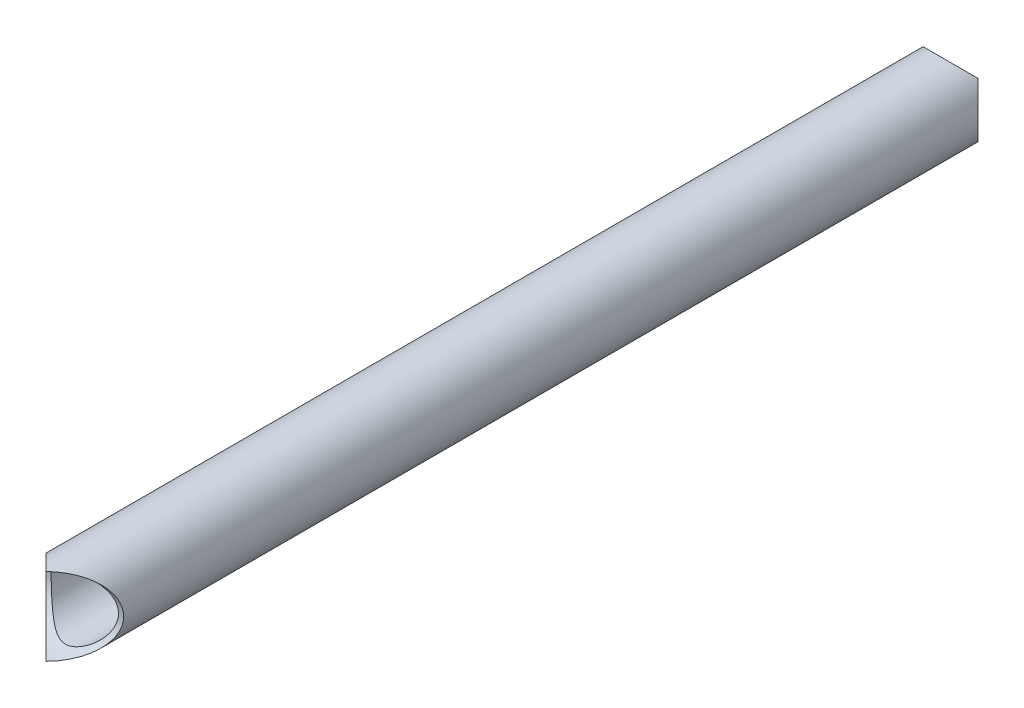
ISO-10303-21;
HEADER;
FILE_DESCRIPTION(('STEP AP214'),'2;1');
FILE_NAME('part.step','',(''),(''),'','','');
FILE_SCHEMA(('AUTOMOTIVE_DESIGN { 1 0 10303 214 1 1 1 1 }'));
ENDSEC;
DATA;
#1=APPLICATION_CONTEXT('core data for automotive mechanical design processes');
#2=APPLICATION_PROTOCOL_DEFINITION('international standard','automotive_design',2000,#1);
#3=PRODUCT_CONTEXT('',#1,'mechanical');
#4=PRODUCT('Part','Part','',(#3));
#5=PRODUCT_RELATED_PRODUCT_CATEGORY('part','',(#4));
#6=PRODUCT_DEFINITION_FORMATION('','',#4);
#7=PRODUCT_DEFINITION_CONTEXT('part definition',#1,'design');
#8=PRODUCT_DEFINITION('design','',#6,#7);
#9=PRODUCT_DEFINITION_SHAPE('','',#8);
#10=(LENGTH_UNIT() NAMED_UNIT(*) SI_UNIT(.MILLI.,.METRE.));
#11=(NAMED_UNIT(*) PLANE_ANGLE_UNIT() SI_UNIT($,.RADIAN.));
#12=(NAMED_UNIT(*) SI_UNIT($,.STERADIAN.) SOLID_ANGLE_UNIT());
#13=UNCERTAINTY_MEASURE_WITH_UNIT(LENGTH_MEASURE(1.E-05),#10,'distance_accuracy_value','');
#14=(GEOMETRIC_REPRESENTATION_CONTEXT(3) GLOBAL_UNCERTAINTY_ASSIGNED_CONTEXT((#13)) GLOBAL_UNIT_ASSIGNED_CONTEXT((#10,
#11,#12)) REPRESENTATION_CONTEXT('',''));
#15=CARTESIAN_POINT('',(0.,0.,0.));
#16=DIRECTION('',(0.,0.,1.));
#17=DIRECTION('',(1.,0.,0.));
#18=AXIS2_PLACEMENT_3D('',#15,#16,#17);
#19=CARTESIAN_POINT('',(-161.925,-228.6,0.));
#20=DIRECTION('',(1.,0.,0.));
#21=DIRECTION('',(0.,0.,-1.));
#22=AXIS2_PLACEMENT_3D('',#19,#20,#21);
#23=CYLINDRICAL_SURFACE('',#22,9.52499999999998);
#24=CARTESIAN_POINT('',(0.,-228.6,0.));
#25=DIRECTION('',(0.707106781186547,0.,0.707106781186547));
#26=DIRECTION('',(-0.707106781186547,0.,0.707106781186547));
#27=AXIS2_PLACEMENT_3D('',#24,#25,#26);
#28=ELLIPSE('',#27,13.4703841816037,9.52499999999999);
#29=CARTESIAN_POINT('',(0.,-238.125,0.));
#30=VERTEX_POINT('',#29);
#31=CARTESIAN_POINT('',(0.,-219.075,0.));
#32=VERTEX_POINT('',#31);
#33=EDGE_CURVE('E73',#30,#32,#28,.T.);
#34=ORIENTED_EDGE('',*,*,#33,.T.);
#35=CARTESIAN_POINT('',(0.,-228.6,0.));
#36=DIRECTION('',(-0.707106781186547,0.,0.707106781186547));
#37=DIRECTION('',(0.707106781186547,0.,0.707106781186547));
#38=AXIS2_PLACEMENT_3D('',#35,#36,#37);
#39=ELLIPSE('',#38,13.4703841816037,9.52499999999999);
#40=EDGE_CURVE('E71',#32,#30,#39,.T.);
#41=ORIENTED_EDGE('',*,*,#40,.T.);
#42=EDGE_LOOP('',(#34,#41));
#43=FACE_BOUND('',#42,.T.);
#44=CARTESIAN_POINT('',(8.255,-228.6,-9.52499999999998));
#45=CARTESIAN_POINT('',(8.2549991309736,-228.406250866017,-9.52499914862957));
#46=CARTESIAN_POINT('',(8.24816678082066,-228.212489304632,-9.51907602387494));
#47=CARTESIAN_POINT('',(8.22096978778912,-227.826631422453,-9.49551993069773));
#48=CARTESIAN_POINT('',(8.20060395213658,-227.634535249952,-9.47788593013703));
#49=CARTESIAN_POINT('',(8.14671669800962,-227.253494245892,-9.43129946891753));
#50=CARTESIAN_POINT('',(8.11318830370018,-227.064551140828,-9.4023410066018));
#51=CARTESIAN_POINT('',(8.03357968300137,-226.691325809148,-9.33373426055012));
#52=CARTESIAN_POINT('',(7.98749944772571,-226.507043585832,-9.29408596924612));
#53=CARTESIAN_POINT('',(7.88387682013201,-226.145482745751,-9.20518387045815));
#54=CARTESIAN_POINT('',(7.82641012090954,-225.968166681786,-9.15599353806628));
#55=CARTESIAN_POINT('',(7.70062697305925,-225.620129557817,-9.04871137350904));
#56=CARTESIAN_POINT('',(7.63230577878792,-225.44941142324,-8.99061564825054));
#57=CARTESIAN_POINT('',(7.48568628536985,-225.115348117664,-8.86648613376939));
#58=CARTESIAN_POINT('',(7.40738906925857,-224.952002148917,-8.80045320628406));
#59=CARTESIAN_POINT('',(7.24162523096909,-224.633112425986,-8.66139148346517));
#60=CARTESIAN_POINT('',(7.15415660082005,-224.477570391447,-8.58836115643808));
#61=CARTESIAN_POINT('',(6.93563606350437,-224.116475044909,-8.40705776916898));
#62=CARTESIAN_POINT('',(6.80073731523927,-223.914627571719,-8.29601262769738));
#63=CARTESIAN_POINT('',(6.51661799509544,-223.526881378591,-8.064743848003));
#64=CARTESIAN_POINT('',(6.36739233738686,-223.340988366918,-7.94451695352175));
#65=CARTESIAN_POINT('',(6.05568545559865,-222.984857023593,-7.69694275303351));
#66=CARTESIAN_POINT('',(5.89317377902942,-222.814656672967,-7.56957931222031));
#67=CARTESIAN_POINT('',(5.55624676339453,-222.490349874275,-7.31032763517803));
#68=CARTESIAN_POINT('',(5.38183301047559,-222.336241288616,-7.17844000303208));
#69=CARTESIAN_POINT('',(5.01788704155433,-222.040890582044,-6.90973126096918));
#70=CARTESIAN_POINT('',(4.82811425764211,-221.899986610464,-6.77286471020445));
#71=CARTESIAN_POINT('',(4.43682954916942,-221.634695381101,-6.4997229701736));
#72=CARTESIAN_POINT('',(4.23531384968986,-221.510313477172,-6.36344798637052));
#73=CARTESIAN_POINT('',(3.82063329870359,-221.278516699451,-6.09531136489423));
#74=CARTESIAN_POINT('',(3.60749309828619,-221.171067666948,-5.96344127621439));
#75=CARTESIAN_POINT('',(3.16843181970336,-220.973470149248,-5.70855763052586));
#76=CARTESIAN_POINT('',(2.94252102945852,-220.883307987932,-5.58553712092024));
#77=CARTESIAN_POINT('',(2.4668144299832,-220.717996418519,-5.34987442057174));
#78=CARTESIAN_POINT('',(2.21641466916663,-220.643633336703,-5.23788214298108));
#79=CARTESIAN_POINT('',(1.69963891728647,-220.517519256837,-5.04111943195066));
#80=CARTESIAN_POINT('',(1.43329846759253,-220.465719940797,-4.95629093434712));
#81=CARTESIAN_POINT('',(1.04394084534311,-220.410426737363,-4.86390243338424));
#82=CARTESIAN_POINT('',(0.926240140688908,-220.396260607156,-4.83991842714093));
#83=CARTESIAN_POINT('',(0.688990887447115,-220.372941215348,-4.80017344286397));
#84=CARTESIAN_POINT('',(0.569443240154016,-220.363785583455,-4.78440857680622));
#85=CARTESIAN_POINT('',(0.32932033933736,-220.350695800613,-4.76180407323091));
#86=CARTESIAN_POINT('',(0.208746073071973,-220.346757102303,-4.75495666286135));
#87=CARTESIAN_POINT('',(-0.0326338460709517,-220.344182219285,-4.75048470187358));
#88=CARTESIAN_POINT('',(-0.153439501382194,-220.345546090658,-4.75286024879897));
#89=CARTESIAN_POINT('',(-0.394165546022784,-220.353537911923,-4.76671281142092));
#90=CARTESIAN_POINT('',(-0.514086996621967,-220.360157910279,-4.77817607905761));
#91=CARTESIAN_POINT('',(-0.752426471254528,-220.378492094755,-4.80965247391343));
#92=CARTESIAN_POINT('',(-0.870843834060159,-220.390208446644,-4.82966923600071));
#93=CARTESIAN_POINT('',(-1.22310602414186,-220.432691819621,-4.90141020066696));
#94=CARTESIAN_POINT('',(-1.45376292887387,-220.47078599086,-4.96481146964582));
#95=CARTESIAN_POINT('',(-1.8637072758493,-220.555900672935,-5.10130504482208));
#96=CARTESIAN_POINT('',(-2.04487996617523,-220.60016196055,-5.17071608363481));
#97=CARTESIAN_POINT('',(-2.39953345699059,-220.699294360388,-5.32095731682424));
#98=CARTESIAN_POINT('',(-2.57300885110583,-220.754172789204,-5.401795375498));
#99=CARTESIAN_POINT('',(-2.91302040075858,-220.87394281657,-5.57175995210491));
#100=CARTESIAN_POINT('',(-3.07953040069081,-220.938868485421,-5.66091424590629));
#101=CARTESIAN_POINT('',(-3.40543837179338,-221.078072533404,-5.84461572787481));
#102=CARTESIAN_POINT('',(-3.56483714546782,-221.152349853564,-5.93916230476347));
#103=CARTESIAN_POINT('',(-3.95950975045312,-221.351633994807,-6.18246639561205));
#104=CARTESIAN_POINT('',(-4.19036061822675,-221.482704521305,-6.33346592764865));
#105=CARTESIAN_POINT('',(-4.63747538270588,-221.765614163585,-6.63777489853455));
#106=CARTESIAN_POINT('',(-4.85373191319782,-221.917463651808,-6.79108545677487));
#107=CARTESIAN_POINT('',(-5.27132385376,-222.241702561116,-7.09556835836744));
#108=CARTESIAN_POINT('',(-5.47267772045483,-222.414065861768,-7.2467431523944));
#109=CARTESIAN_POINT('',(-5.85993838639313,-222.77960613111,-7.54347617660761));
#110=CARTESIAN_POINT('',(-6.04585204532008,-222.972773768413,-7.68903688542415));
#111=CARTESIAN_POINT('',(-6.35820893639354,-223.33119127101,-7.93730120225209));
#112=CARTESIAN_POINT('',(-6.48822041734563,-223.492023598625,-8.04190982332076));
#113=CARTESIAN_POINT('',(-6.73756594349463,-223.825736010478,-8.24439807207286));
#114=CARTESIAN_POINT('',(-6.8569023290982,-223.998613439092,-8.34227917360141));
#115=CARTESIAN_POINT('',(-7.08366003651115,-224.356002397326,-8.52964066539285));
#116=CARTESIAN_POINT('',(-7.19109566852846,-224.540499526382,-8.61913112474718));
#117=CARTESIAN_POINT('',(-7.39290924178342,-224.920837747688,-8.78821213101048));
#118=CARTESIAN_POINT('',(-7.4872896182541,-225.116676714618,-8.86780452395279));
#119=CARTESIAN_POINT('',(-7.64607452720217,-225.483103214577,-9.00231134156521));
#120=CARTESIAN_POINT('',(-7.71282515872356,-225.651989745094,-9.05909739341582));
#121=CARTESIAN_POINT('',(-7.83572387058532,-225.996188653913,-9.16395879695111));
#122=CARTESIAN_POINT('',(-7.89187416542448,-226.171499680925,-9.21203596790855));
#123=CARTESIAN_POINT('',(-7.99277926561637,-226.527624248783,-9.29862621941021));
#124=CARTESIAN_POINT('',(-8.03753797954922,-226.708435878407,-9.33714258026411));
#125=CARTESIAN_POINT('',(-8.11497986008862,-227.074508745958,-9.40388814271986));
#126=CARTESIAN_POINT('',(-8.14766289484144,-227.259770032446,-9.43211723199546));
#127=CARTESIAN_POINT('',(-8.20051181828125,-227.634306222712,-9.47780652362297));
#128=CARTESIAN_POINT('',(-8.22061737363726,-227.823596035694,-9.49521481683601));
#129=CARTESIAN_POINT('',(-8.24768993736896,-228.20381950668,-9.51866289629086));
#130=CARTESIAN_POINT('',(-8.25465691616095,-228.394753168383,-9.52470265693453));
#131=CARTESIAN_POINT('',(-8.2553183095402,-228.77664531477,-9.52527587201024));
#132=CARTESIAN_POINT('',(-8.24901373573472,-228.967603796453,-9.51981020342901));
#133=CARTESIAN_POINT('',(-8.22325492565545,-229.347952184751,-9.49749861914188));
#134=CARTESIAN_POINT('',(-8.20380124943699,-229.537342157826,-9.4806531881304));
#135=CARTESIAN_POINT('',(-8.1540812277602,-229.898723012674,-9.43766380719513));
#136=CARTESIAN_POINT('',(-8.12475103759838,-230.070940627884,-9.41232559052558));
#137=CARTESIAN_POINT('',(-8.05561104968294,-230.411738571797,-9.35270884257686));
#138=CARTESIAN_POINT('',(-8.01579775061753,-230.580317664858,-9.31842732431004));
#139=CARTESIAN_POINT('',(-7.92625943872895,-230.912806206632,-9.24151845756411));
#140=CARTESIAN_POINT('',(-7.87653736329026,-231.076717022802,-9.19889358247871));
#141=CARTESIAN_POINT('',(-7.76777500026876,-231.399227506909,-9.10593936756864));
#142=CARTESIAN_POINT('',(-7.70873123855654,-231.557825167848,-9.05560715548279));
#143=CARTESIAN_POINT('',(-7.57702515132398,-231.881239112751,-8.94374675295493));
#144=CARTESIAN_POINT('',(-7.50365911320604,-232.045572644807,-8.88165097638808));
#145=CARTESIAN_POINT('',(-7.34765599089072,-232.366815288716,-8.75025080214971));
#146=CARTESIAN_POINT('',(-7.26501525757022,-232.523721443506,-8.68094356792167));
#147=CARTESIAN_POINT('',(-7.00428589271642,-232.982783680093,-8.46353025136198));
#148=CARTESIAN_POINT('',(-6.81336884998682,-233.273334821802,-8.30591435659428));
#149=CARTESIAN_POINT('',(-6.4528327804719,-233.754931306402,-8.01320461595655));
#150=CARTESIAN_POINT('',(-6.28928934942985,-233.95301288062,-7.88192799380313));
#151=CARTESIAN_POINT('',(-5.94739409173013,-234.330473861314,-7.61190373485776));
#152=CARTESIAN_POINT('',(-5.76904131931243,-234.509852071695,-7.47315562111766));
#153=CARTESIAN_POINT('',(-5.398278386676,-234.850372890798,-7.19079436686123));
#154=CARTESIAN_POINT('',(-5.20583488153909,-235.011469781996,-7.04717014783944));
#155=CARTESIAN_POINT('',(-4.80788440247821,-235.315050172218,-6.75851614265842));
#156=CARTESIAN_POINT('',(-4.60238145150832,-235.457539362408,-6.61348680090241));
#157=CARTESIAN_POINT('',(-4.2217002215374,-235.696611503452,-6.35515925689216));
#158=CARTESIAN_POINT('',(-4.04894034477497,-235.796617427103,-6.24145035992457));
#159=CARTESIAN_POINT('',(-3.69470620817156,-235.984741839882,-6.0176875352289));
#160=CARTESIAN_POINT('',(-3.51323035552958,-236.072858144948,-5.90763428181521));
#161=CARTESIAN_POINT('',(-3.14146809775949,-236.236578933631,-5.69440913102359));
#162=CARTESIAN_POINT('',(-2.95120539019996,-236.312214812114,-5.59122036896025));
#163=CARTESIAN_POINT('',(-2.56091153040397,-236.450454207426,-5.39540026708197));
#164=CARTESIAN_POINT('',(-2.36088739974972,-236.513066926325,-5.30276149380798));
#165=CARTESIAN_POINT('',(-1.91710109618572,-236.633093878315,-5.11946097161144));
#166=CARTESIAN_POINT('',(-1.67147843973417,-236.688052450932,-5.03151344556335));
#167=CARTESIAN_POINT('',(-1.29366079541496,-236.754004837994,-4.92337591366435));
#168=CARTESIAN_POINT('',(-1.16625357807995,-236.773233391453,-4.89130870864691));
#169=CARTESIAN_POINT('',(-0.908760812182209,-236.805851299184,-4.83638807525044));
#170=CARTESIAN_POINT('',(-0.778676743118112,-236.819243792849,-4.81352969366667));
#171=CARTESIAN_POINT('',(-0.515053294315999,-236.839989631339,-4.77793189106003));
#172=CARTESIAN_POINT('',(-0.381491235325672,-236.84726952223,-4.76531560533642));
#173=CARTESIAN_POINT('',(-0.113582080058729,-236.855306107447,-4.75138012581389));
#174=CARTESIAN_POINT('',(0.0207649568470255,-236.85606328888,-4.75006008842709));
#175=CARTESIAN_POINT('',(0.289034938598474,-236.851029854125,-4.75879767507656));
#176=CARTESIAN_POINT('',(0.422957602740172,-236.845235558614,-4.76886169242112));
#177=CARTESIAN_POINT('',(0.689111683742139,-236.827268862574,-4.79979015185113));
#178=CARTESIAN_POINT('',(0.821342817729421,-236.815095409186,-4.82065637679742));
#179=CARTESIAN_POINT('',(1.10454643006355,-236.782206595522,-4.87630241943855));
#180=CARTESIAN_POINT('',(1.25505528789717,-236.760421364586,-4.91279727603147));
#181=CARTESIAN_POINT('',(1.55170325268703,-236.709250007172,-4.9968088443347));
#182=CARTESIAN_POINT('',(1.69783869586883,-236.679857696409,-5.0443345204492));
#183=CARTESIAN_POINT('',(1.98570912314555,-236.613978878295,-5.14835522742285));
#184=CARTESIAN_POINT('',(2.12742964309167,-236.577471421659,-5.20487665227993));
#185=CARTESIAN_POINT('',(2.40595811079111,-236.497933942537,-5.32479592263951));
#186=CARTESIAN_POINT('',(2.54276715365901,-236.454905385378,-5.38819222241241));
#187=CARTESIAN_POINT('',(2.90759118568054,-236.329831049898,-5.56725013397189));
#188=CARTESIAN_POINT('',(3.13110425848443,-236.241836566895,-5.68795470478585));
#189=CARTESIAN_POINT('',(3.56559758605923,-236.049031016719,-5.93823193042164));
#190=CARTESIAN_POINT('',(3.77656911147845,-235.944208420122,-6.06781063001079));
#191=CARTESIAN_POINT('',(4.18706965610036,-235.718175810107,-6.33146122219583));
#192=CARTESIAN_POINT('',(4.38658228697998,-235.596943119533,-6.46553913594523));
#193=CARTESIAN_POINT('',(4.77419601105202,-235.338421490995,-6.73454643258551));
#194=CARTESIAN_POINT('',(4.96229989336762,-235.201136501598,-6.869475598391));
#195=CARTESIAN_POINT('',(5.33822587447611,-234.901555904191,-7.14562965260795));
#196=CARTESIAN_POINT('',(5.52532860119196,-234.738244688044,-7.28673552413448));
#197=CARTESIAN_POINT('',(5.88601693765019,-234.393280486469,-7.5638943285916));
#198=CARTESIAN_POINT('',(6.05959990411033,-234.211623930162,-7.69994627070964));
#199=CARTESIAN_POINT('',(6.39160103031022,-233.830317575679,-7.96385928877271));
#200=CARTESIAN_POINT('',(6.55005185964248,-233.63070843393,-8.09173780370972));
#201=CARTESIAN_POINT('',(6.85042540907245,-233.21332127486,-8.33674937621355));
#202=CARTESIAN_POINT('',(6.99235568599343,-232.995551643368,-8.45388734147134));
#203=CARTESIAN_POINT('',(7.21895608703124,-232.608288566503,-8.64240803344506));
#204=CARTESIAN_POINT('',(7.30828007272975,-232.443156845253,-8.71719498210351));
#205=CARTESIAN_POINT('',(7.47660654907034,-232.104443279242,-8.85879069211981));
#206=CARTESIAN_POINT('',(7.55561158090454,-231.930863529438,-8.92560141738874));
#207=CARTESIAN_POINT('',(7.70228991439693,-231.576001146484,-9.0501032426944));
#208=CARTESIAN_POINT('',(7.76997311226874,-231.394725415898,-9.10780230457899));
#209=CARTESIAN_POINT('',(7.89311833522138,-231.025204306969,-9.2130828730719));
#210=CARTESIAN_POINT('',(7.94858170019484,-230.836959695403,-9.26066548891849));
#211=CARTESIAN_POINT('',(8.039551741935,-230.481346233512,-9.33887209356159));
#212=CARTESIAN_POINT('',(8.07676302214277,-230.314728334993,-9.37093582182724));
#213=CARTESIAN_POINT('',(8.14097036810243,-229.978041246021,-9.42633196678231));
#214=CARTESIAN_POINT('',(8.16796357789891,-229.807971104638,-9.44966194236373));
#215=CARTESIAN_POINT('',(8.21131805296771,-229.465488145167,-9.48716109489849));
#216=CARTESIAN_POINT('',(8.22768016098987,-229.293075513879,-9.50133099798964));
#217=CARTESIAN_POINT('',(8.24951956226246,-228.947111623887,-9.52024913405288));
#218=CARTESIAN_POINT('',(8.2550007784753,-228.773560798195,-9.52500076265902));
#219=CARTESIAN_POINT('',(8.255,-228.6,-9.52499999999998));
#220=B_SPLINE_CURVE_WITH_KNOTS('',3,(#44,#45,#46,#47,#48,#49,#50,#51,#52,#53,#54,#55,#56,#57,
#58,#59,#60,#61,#62,#63,#64,#65,#66,#67,#68,#69,#70,#71,#72,#73,#74,#75,#76,#77,#78,#79,#80,#81,
#82,#83,#84,#85,#86,#87,#88,#89,#90,#91,#92,#93,#94,#95,#96,#97,#98,#99,#100,#101,#102,#103,
#104,#105,#106,#107,#108,#109,#110,#111,#112,#113,#114,#115,#116,#117,#118,#119,#120,#121,#122,
#123,#124,#125,#126,#127,#128,#129,#130,#131,#132,#133,#134,#135,#136,#137,#138,#139,#140,#141,
#142,#143,#144,#145,#146,#147,#148,#149,#150,#151,#152,#153,#154,#155,#156,#157,#158,#159,#160,
#161,#162,#163,#164,#165,#166,#167,#168,#169,#170,#171,#172,#173,#174,#175,#176,#177,#178,#179,
#180,#181,#182,#183,#184,#185,#186,#187,#188,#189,#190,#191,#192,#193,#194,#195,#196,#197,#198,
#199,#200,#201,#202,#203,#204,#205,#206,#207,#208,#209,#210,#211,#212,#213,#214,#215,#216,#217,
#218,#219),.UNSPECIFIED.,.T.,.F.,(4,2,2,2,2,2,2,2,2,2,2,2,2,2,2,2,2,2,2,2,2,2,2,2,2,2,2,2,2,2,2,
2,2,2,2,2,2,2,2,2,2,2,2,2,2,2,2,2,2,2,2,2,2,2,2,2,2,2,2,2,2,2,2,2,2,2,2,2,2,2,2,2,2,2,2,2,2,2,2,
2,2,2,2,2,2,2,2,4),(0.,0.581060302241147,1.16217182303358,1.74359173542288,2.3250120594397,
2.90268969124201,3.48062058537871,4.05848879048118,4.63648377810275,5.4362169542025,
6.2362350802626,7.03814127970881,7.83994081992862,8.65857780584574,9.47747942119568,
10.2947073130675,11.1112859813718,11.9620431912297,12.8109695269324,13.1734956172863,
13.5358500604876,13.8978884475343,14.2599306635728,14.6214262186982,14.9830755469357,
15.706963144709,16.3031815010825,16.8998122025499,17.4985123074858,18.0971446771322,
19.0121600805803,19.927633918925,20.841954302152,21.7558662790183,22.450561462509,
23.1451039659047,23.8388020282263,24.5323705181271,25.1026275067059,25.6727652316906,
26.2427070714556,26.8126551342036,27.3853166471828,27.9579794496038,28.5305986031097,
29.1031933687764,29.6321866176356,30.1613567724987,30.6903702914557,31.2195814376323,
31.7901536941553,32.3609512342489,33.5023725912856,34.3667872613035,35.2312571774336,
36.0978433977629,36.9641639487797,37.6529096955541,38.341781789667,39.0288936791848,
39.715518398605,40.512573766315,40.9105237639805,41.3082594272077,41.7107088469782,
42.1131282121322,42.5157736890734,42.918485642225,43.38692566356,43.8557477127696,
44.32597156752,44.7960899166668,45.6013224389748,46.4071090223582,47.2140207141777,
48.020734336611,48.8767355197429,49.732903643882,50.5871794481831,51.441062941544,
52.0468024868874,52.6523925776822,53.2574505352096,53.862442115674,54.3830405578493,
54.9037844002805,55.4244869572118,55.9450017475653),.UNSPECIFIED.);
#221=CARTESIAN_POINT('',(8.255,-228.6,-9.52499999999998));
#222=VERTEX_POINT('',#221);
#223=EDGE_CURVE('E88',#222,#222,#220,.T.);
#224=ORIENTED_EDGE('',*,*,#223,.F.);
#225=EDGE_LOOP('',(#224));
#226=FACE_BOUND('',#225,.T.);
#227=ADVANCED_FACE('F33',(#43,#226),#23,.F.);
#228=CARTESIAN_POINT('',(0.,-219.075,-228.6));
#229=DIRECTION('',(0.,-1.,0.));
#230=DIRECTION('',(0.,0.,-1.));
#231=AXIS2_PLACEMENT_3D('',#228,#229,#230);
#232=CYLINDRICAL_SURFACE('',#231,9.525);
#233=CARTESIAN_POINT('',(0.,-228.6,-228.6));
#234=DIRECTION('',(0.707106781186547,-0.707106781186547,0.));
#235=DIRECTION('',(-0.707106781186547,-0.707106781186547,0.));
#236=AXIS2_PLACEMENT_3D('',#233,#234,#235);
#237=ELLIPSE('',#236,13.4703841816037,9.52499999999999);
#238=CARTESIAN_POINT('',(5.83716647869488,-222.762833521305,-221.073173809633));
#239=VERTEX_POINT('',#238);
#240=CARTESIAN_POINT('',(6.73519209080188,-221.864807909198,-221.864807909198));
#241=VERTEX_POINT('',#240);
#242=EDGE_CURVE('E47',#239,#241,#237,.F.);
#243=ORIENTED_EDGE('',*,*,#242,.F.);
#244=CARTESIAN_POINT('',(0.,-220.345,-219.075));
#245=CARTESIAN_POINT('',(-0.19374913398268,-220.345000869026,-219.075000851371));
#246=CARTESIAN_POINT('',(-0.387510695368521,-220.351833219179,-219.080923976125));
#247=CARTESIAN_POINT('',(-0.773368577546671,-220.379030212211,-219.104480069302));
#248=CARTESIAN_POINT('',(-0.965464750048011,-220.399396047863,-219.122114069863));
#249=CARTESIAN_POINT('',(-1.3465057541077,-220.45328330199,-219.168700531083));
#250=CARTESIAN_POINT('',(-1.53544885917171,-220.4868116963,-219.197658993398));
#251=CARTESIAN_POINT('',(-1.90867419085189,-220.566420316999,-219.26626573945));
#252=CARTESIAN_POINT('',(-2.0929564141682,-220.612500552274,-219.305914030754));
#253=CARTESIAN_POINT('',(-2.45451725424895,-220.716123179868,-219.394816129542));
#254=CARTESIAN_POINT('',(-2.63183331821414,-220.77358987909,-219.444006461934));
#255=CARTESIAN_POINT('',(-2.97987044218346,-220.899373026941,-219.551288626491));
#256=CARTESIAN_POINT('',(-3.1505885767598,-220.967694221212,-219.60938435175));
#257=CARTESIAN_POINT('',(-3.48465188233565,-221.11431371463,-219.733513866231));
#258=CARTESIAN_POINT('',(-3.64799785108294,-221.192610930741,-219.799546793716));
#259=CARTESIAN_POINT('',(-3.96688757401417,-221.358374769031,-219.938608516535));
#260=CARTESIAN_POINT('',(-4.12242960855341,-221.44584339918,-220.011638843562));
#261=CARTESIAN_POINT('',(-4.48352495509106,-221.664363936496,-220.192942230831));
#262=CARTESIAN_POINT('',(-4.68537242828053,-221.799262684761,-220.303987372303));
#263=CARTESIAN_POINT('',(-5.07311862140911,-222.083382004905,-220.535256151997));
#264=CARTESIAN_POINT('',(-5.25901163308174,-222.232607662613,-220.655483046478));
#265=CARTESIAN_POINT('',(-5.6151429764073,-222.544314544401,-220.903057246967));
#266=CARTESIAN_POINT('',(-5.78534332703313,-222.706826220971,-221.03042068778));
#267=CARTESIAN_POINT('',(-6.10965012572526,-223.043753236606,-221.289672364822));
#268=CARTESIAN_POINT('',(-6.26375871138404,-223.218166989524,-221.421559996968));
#269=CARTESIAN_POINT('',(-6.55910941795627,-223.582112958446,-221.690268739031));
#270=CARTESIAN_POINT('',(-6.7000133895365,-223.771885742358,-221.827135289796));
#271=CARTESIAN_POINT('',(-6.96530461889879,-224.163170450831,-222.100277029826));
#272=CARTESIAN_POINT('',(-7.08968652282799,-224.36468615031,-222.23655201363));
#273=CARTESIAN_POINT('',(-7.32148330054924,-224.779366701296,-222.504688635106));
#274=CARTESIAN_POINT('',(-7.42893233305181,-224.992506901714,-222.636558723786));
#275=CARTESIAN_POINT('',(-7.62652985075219,-225.431568180297,-222.891442369474));
#276=CARTESIAN_POINT('',(-7.71669201206841,-225.657478970542,-223.01446287908));
#277=CARTESIAN_POINT('',(-7.88200358148072,-226.133185570017,-223.250125579428));
#278=CARTESIAN_POINT('',(-7.95636666329742,-226.383585330833,-223.362117857019));
#279=CARTESIAN_POINT('',(-8.08248074316302,-226.900361082714,-223.558880568049));
#280=CARTESIAN_POINT('',(-8.1342800592027,-227.166701532408,-223.643709065653));
#281=CARTESIAN_POINT('',(-8.18957326263654,-227.556059154657,-223.736097566616));
#282=CARTESIAN_POINT('',(-8.20373939284397,-227.673759859311,-223.760081572859));
#283=CARTESIAN_POINT('',(-8.22705878465154,-227.911009112553,-223.799826557136));
#284=CARTESIAN_POINT('',(-8.23621441654546,-228.030556759846,-223.815591423194));
#285=CARTESIAN_POINT('',(-8.2493041993867,-228.270679660663,-223.838195926769));
#286=CARTESIAN_POINT('',(-8.25324289769712,-228.391253926928,-223.845043337139));
#287=CARTESIAN_POINT('',(-8.25581778071506,-228.632633846071,-223.849515298126));
#288=CARTESIAN_POINT('',(-8.25445390934166,-228.753439501382,-223.847139751201));
#289=CARTESIAN_POINT('',(-8.24646208807654,-228.994165546023,-223.833287188579));
#290=CARTESIAN_POINT('',(-8.2398420897209,-229.114086996622,-223.821823920942));
#291=CARTESIAN_POINT('',(-8.22150790524539,-229.352426471255,-223.790347526087));
#292=CARTESIAN_POINT('',(-8.20979155335593,-229.47084383406,-223.770330763999));
#293=CARTESIAN_POINT('',(-8.16730818037862,-229.823106024142,-223.698589799333));
#294=CARTESIAN_POINT('',(-8.12921400914041,-230.053762928874,-223.635188530354));
#295=CARTESIAN_POINT('',(-8.04409932706535,-230.463707275849,-223.498694955178));
#296=CARTESIAN_POINT('',(-7.99983803945024,-230.644879966175,-223.429283916365));
#297=CARTESIAN_POINT('',(-7.90070563961175,-230.999533456991,-223.279042683176));
#298=CARTESIAN_POINT('',(-7.84582721079586,-231.173008851106,-223.198204624502));
#299=CARTESIAN_POINT('',(-7.72605718342994,-231.513020400759,-223.028240047895));
#300=CARTESIAN_POINT('',(-7.66113151457858,-231.679530400691,-222.939085754094));
#301=CARTESIAN_POINT('',(-7.52192746659584,-232.005438371794,-222.755384272125));
#302=CARTESIAN_POINT('',(-7.44765014643552,-232.164837145468,-222.660837695236));
#303=CARTESIAN_POINT('',(-7.24836600519316,-232.559509750453,-222.417533604388));
#304=CARTESIAN_POINT('',(-7.11729547869542,-232.790360618227,-222.266534072351));
#305=CARTESIAN_POINT('',(-6.83438583641457,-233.237475382706,-221.962225101465));
#306=CARTESIAN_POINT('',(-6.68253634819236,-233.453731913198,-221.808914543225));
#307=CARTESIAN_POINT('',(-6.35829743888427,-233.87132385376,-221.504431641633));
#308=CARTESIAN_POINT('',(-6.18593413823202,-234.072677720455,-221.353256847606));
#309=CARTESIAN_POINT('',(-5.82039386888942,-234.459938386393,-221.056523823392));
#310=CARTESIAN_POINT('',(-5.62722623158674,-234.64585204532,-220.910963114576));
#311=CARTESIAN_POINT('',(-5.26880872898991,-234.958208936394,-220.662698797748));
#312=CARTESIAN_POINT('',(-5.10797640137497,-235.088220417346,-220.558090176679));
#313=CARTESIAN_POINT('',(-4.77426398952177,-235.337565943495,-220.355601927927));
#314=CARTESIAN_POINT('',(-4.60138656090798,-235.456902329098,-220.257720826399));
#315=CARTESIAN_POINT('',(-4.2439976026734,-235.683660036511,-220.070359334607));
#316=CARTESIAN_POINT('',(-4.05950047361767,-235.791095668529,-219.980868875253));
#317=CARTESIAN_POINT('',(-3.67916225231211,-235.992909241784,-219.81178786899));
#318=CARTESIAN_POINT('',(-3.48332328538176,-236.087289618254,-219.732195476047));
#319=CARTESIAN_POINT('',(-3.11689678542335,-236.246074527202,-219.597688658435));
#320=CARTESIAN_POINT('',(-2.94801025490547,-236.312825158724,-219.540902606584));
#321=CARTESIAN_POINT('',(-2.60381134608641,-236.435723870585,-219.436041203049));
#322=CARTESIAN_POINT('',(-2.42850031907459,-236.491874165425,-219.387964032091));
#323=CARTESIAN_POINT('',(-2.07237575121671,-236.592779265616,-219.30137378059));
#324=CARTESIAN_POINT('',(-1.89156412159269,-236.637537979549,-219.262857419736));
#325=CARTESIAN_POINT('',(-1.52549125404211,-236.714979860089,-219.19611185728));
#326=CARTESIAN_POINT('',(-1.34022996755348,-236.747662894841,-219.167882768005));
#327=CARTESIAN_POINT('',(-0.965693777288022,-236.800511818281,-219.122193476377));
#328=CARTESIAN_POINT('',(-0.776403964305413,-236.820617373637,-219.104785183164));
#329=CARTESIAN_POINT('',(-0.396180493319812,-236.847689937369,-219.081337103709));
#330=CARTESIAN_POINT('',(-0.205246831616394,-236.854656916161,-219.075297343066));
#331=CARTESIAN_POINT('',(0.176645314770566,-236.85531830954,-219.07472412799));
#332=CARTESIAN_POINT('',(0.367603796452821,-236.849013735735,-219.080189796571));
#333=CARTESIAN_POINT('',(0.747952184751139,-236.823254925655,-219.102501380858));
#334=CARTESIAN_POINT('',(0.937342157826403,-236.803801249437,-219.11934681187));
#335=CARTESIAN_POINT('',(1.29872301267435,-236.75408122776,-219.162336192805));
#336=CARTESIAN_POINT('',(1.47094062788416,-236.724751037598,-219.187674409475));
#337=CARTESIAN_POINT('',(1.81173857179724,-236.655611049683,-219.247291157423));
#338=CARTESIAN_POINT('',(1.98031766485832,-236.615797750618,-219.28157267569));
#339=CARTESIAN_POINT('',(2.31280620663191,-236.526259438729,-219.358481542436));
#340=CARTESIAN_POINT('',(2.47671702280222,-236.47653736329,-219.401106417521));
#341=CARTESIAN_POINT('',(2.79922750690906,-236.367775000269,-219.494060632431));
#342=CARTESIAN_POINT('',(2.95782516784806,-236.308731238557,-219.544392844517));
#343=CARTESIAN_POINT('',(3.28123911275147,-236.177025151324,-219.656253247045));
#344=CARTESIAN_POINT('',(3.4455726448075,-236.103659113206,-219.718349023612));
#345=CARTESIAN_POINT('',(3.76681528871589,-235.947655990891,-219.84974919785));
#346=CARTESIAN_POINT('',(3.92372144350641,-235.86501525757,-219.919056432078));
#347=CARTESIAN_POINT('',(4.38278368009278,-235.604285892716,-220.136469748638));
#348=CARTESIAN_POINT('',(4.67333482180181,-235.413368849987,-220.294085643406));
#349=CARTESIAN_POINT('',(5.1549313064018,-235.052832780472,-220.586795384044));
#350=CARTESIAN_POINT('',(5.35301288062009,-234.88928934943,-220.718072006197));
#351=CARTESIAN_POINT('',(5.73047386131386,-234.54739409173,-220.988096265142));
#352=CARTESIAN_POINT('',(5.90985207169504,-234.369041319312,-221.126844378883));
#353=CARTESIAN_POINT('',(6.2503728907978,-233.998278386676,-221.409205633139));
#354=CARTESIAN_POINT('',(6.41146978199639,-233.805834881539,-221.552829852161));
#355=CARTESIAN_POINT('',(6.71505017221831,-233.407884402478,-221.841483857342));
#356=CARTESIAN_POINT('',(6.85753936240803,-233.202381451508,-221.986513199098));
#357=CARTESIAN_POINT('',(7.09661150345158,-232.821700221537,-222.244840743108));
#358=CARTESIAN_POINT('',(7.19661742710287,-232.648940344775,-222.358549640076));
#359=CARTESIAN_POINT('',(7.38474183988217,-232.294706208172,-222.582312464771));
#360=CARTESIAN_POINT('',(7.47285814494784,-232.11323035553,-222.692365718185));
#361=CARTESIAN_POINT('',(7.63657893363065,-231.741468097759,-222.905590868977));
#362=CARTESIAN_POINT('',(7.71221481211429,-231.5512053902,-223.00877963104));
#363=CARTESIAN_POINT('',(7.85045420742641,-231.160911530404,-223.204599732918));
#364=CARTESIAN_POINT('',(7.91306692632471,-230.96088739975,-223.297238506192));
#365=CARTESIAN_POINT('',(8.03309387831453,-230.517101096186,-223.480539028389));
#366=CARTESIAN_POINT('',(8.08805245093232,-230.271478439734,-223.568486554437));
#367=CARTESIAN_POINT('',(8.15400483799359,-229.893660795415,-223.676624086336));
#368=CARTESIAN_POINT('',(8.17323339145289,-229.76625357808,-223.708691291353));
#369=CARTESIAN_POINT('',(8.20585129918379,-229.508760812182,-223.76361192475));
#370=CARTESIAN_POINT('',(8.21924379284914,-229.378676743118,-223.786470306333));
#371=CARTESIAN_POINT('',(8.23998963133893,-229.115053294316,-223.82206810894));
#372=CARTESIAN_POINT('',(8.24726952222987,-228.981491235326,-223.834684394664));
#373=CARTESIAN_POINT('',(8.25530610744689,-228.713582080059,-223.848619874186));
#374=CARTESIAN_POINT('',(8.25606328887974,-228.579235043153,-223.849939911573));
#375=CARTESIAN_POINT('',(8.25102985412451,-228.310965061402,-223.841202324924));
#376=CARTESIAN_POINT('',(8.24523555861444,-228.17704239726,-223.831138307579));
#377=CARTESIAN_POINT('',(8.22726886257429,-227.910888316258,-223.800209848149));
#378=CARTESIAN_POINT('',(8.21509540918585,-227.778657182271,-223.779343623203));
#379=CARTESIAN_POINT('',(8.18220659552174,-227.495453569936,-223.723697580562));
#380=CARTESIAN_POINT('',(8.16042136458583,-227.344944712103,-223.687202723969));
#381=CARTESIAN_POINT('',(8.10925000717225,-227.048296747313,-223.603191155665));
#382=CARTESIAN_POINT('',(8.07985769640948,-226.902161304131,-223.555665479551));
#383=CARTESIAN_POINT('',(8.01397887829543,-226.614290876854,-223.451644772577));
#384=CARTESIAN_POINT('',(7.97747142165906,-226.472570356908,-223.39512334772));
#385=CARTESIAN_POINT('',(7.89793394253719,-226.194041889209,-223.275204077361));
#386=CARTESIAN_POINT('',(7.85490538537819,-226.057232846341,-223.211807777588));
#387=CARTESIAN_POINT('',(7.72983104989827,-225.692408814319,-223.032749866028));
#388=CARTESIAN_POINT('',(7.64183656689502,-225.468895741516,-222.912045295214));
#389=CARTESIAN_POINT('',(7.44903101671938,-225.034402413941,-222.661768069578));
#390=CARTESIAN_POINT('',(7.34420842012193,-224.823430888522,-222.532189369989));
#391=CARTESIAN_POINT('',(7.11817581010648,-224.4129303439,-222.268538777804));
#392=CARTESIAN_POINT('',(6.99694311953325,-224.21341771302,-222.134460864055));
#393=CARTESIAN_POINT('',(6.73842149099522,-223.825803988948,-221.865453567415));
#394=CARTESIAN_POINT('',(6.60113650159796,-223.637700106632,-221.730524401609));
#395=CARTESIAN_POINT('',(6.30155590419078,-223.261774125524,-221.454370347392));
#396=CARTESIAN_POINT('',(6.1382446880444,-223.074671398808,-221.313264475866));
#397=CARTESIAN_POINT('',(5.7932804864694,-222.71398306235,-221.036105671408));
#398=CARTESIAN_POINT('',(5.61162393016206,-222.54040009589,-220.90005372929));
#399=CARTESIAN_POINT('',(5.23031757567863,-222.20839896969,-220.636140711227));
#400=CARTESIAN_POINT('',(5.03070843392941,-222.049948140357,-220.50826219629));
#401=CARTESIAN_POINT('',(4.61332127485981,-221.749574590927,-220.263250623786));
#402=CARTESIAN_POINT('',(4.39555164336818,-221.607644314007,-220.146112658529));
#403=CARTESIAN_POINT('',(4.00828856650273,-221.381043912969,-219.957591966555));
#404=CARTESIAN_POINT('',(3.84315684525282,-221.29171992727,-219.882805017897));
#405=CARTESIAN_POINT('',(3.50444327924162,-221.12339345093,-219.74120930788));
#406=CARTESIAN_POINT('',(3.33086352943789,-221.044388419095,-219.674398582611));
#407=CARTESIAN_POINT('',(2.97600114648413,-220.897710085603,-219.549896757306));
#408=CARTESIAN_POINT('',(2.79472541589759,-220.830026887731,-219.492197695421));
#409=CARTESIAN_POINT('',(2.42520430696851,-220.706881664779,-219.386917126928));
#410=CARTESIAN_POINT('',(2.23695969540338,-220.651418299805,-219.339334511082));
#411=CARTESIAN_POINT('',(1.88134623351216,-220.560448258065,-219.261127906438));
#412=CARTESIAN_POINT('',(1.71472833499281,-220.523236977857,-219.229064178173));
#413=CARTESIAN_POINT('',(1.37804124602048,-220.459029631898,-219.173668033218));
#414=CARTESIAN_POINT('',(1.20797110463792,-220.432036422101,-219.150338057636));
#415=CARTESIAN_POINT('',(0.865488145166964,-220.388681947032,-219.112838905102));
#416=CARTESIAN_POINT('',(0.693075513879144,-220.37231983901,-219.09866900201));
#417=CARTESIAN_POINT('',(0.347111623887321,-220.350480437738,-219.079750865947));
#418=CARTESIAN_POINT('',(0.173560798194583,-220.344999221525,-219.074999237341));
#419=CARTESIAN_POINT('',(0.,-220.345,-219.075));
#420=B_SPLINE_CURVE_WITH_KNOTS('',3,(#244,#245,#246,#247,#248,#249,#250,#251,#252,#253,#254,
#255,#256,#257,#258,#259,#260,#261,#262,#263,#264,#265,#266,#267,#268,#269,#270,#271,#272,#273,
#274,#275,#276,#277,#278,#279,#280,#281,#282,#283,#284,#285,#286,#287,#288,#289,#290,#291,#292,
#293,#294,#295,#296,#297,#298,#299,#300,#301,#302,#303,#304,#305,#306,#307,#308,#309,#310,#311,
#312,#313,#314,#315,#316,#317,#318,#319,#320,#321,#322,#323,#324,#325,#326,#327,#328,#329,#330,
#331,#332,#333,#334,#335,#336,#337,#338,#339,#340,#341,#342,#343,#344,#345,#346,#347,#348,#349,
#350,#351,#352,#353,#354,#355,#356,#357,#358,#359,#360,#361,#362,#363,#364,#365,#366,#367,#368,
#369,#370,#371,#372,#373,#374,#375,#376,#377,#378,#379,#380,#381,#382,#383,#384,#385,#386,#387,
#388,#389,#390,#391,#392,#393,#394,#395,#396,#397,#398,#399,#400,#401,#402,#403,#404,#405,#406,
#407,#408,#409,#410,#411,#412,#413,#414,#415,#416,#417,#418,#419),.UNSPECIFIED.,.T.,.F.,(4,2,2,
2,2,2,2,2,2,2,2,2,2,2,2,2,2,2,2,2,2,2,2,2,2,2,2,2,2,2,2,2,2,2,2,2,2,2,2,2,2,2,2,2,2,2,2,2,2,2,2,
2,2,2,2,2,2,2,2,2,2,2,2,2,2,2,2,2,2,2,2,2,2,2,2,2,2,2,2,2,2,2,2,2,2,2,2,4),(0.,
0.581060302241171,1.16217182303358,1.74359173542286,2.32501205943971,2.90268969124199,
3.48062058537874,4.05848879048119,4.63648377810277,5.43621695420251,6.23623508026263,
7.03814127970886,7.83994081992866,8.6585778058458,9.47747942119571,10.2947073130676,
11.1112859813718,11.9620431912297,12.8109695269324,13.1734956172863,13.5358500604876,
13.8978884475343,14.2599306635729,14.6214262186982,14.9830755469358,15.7069631447091,
16.3031815010825,16.8998122025499,17.4985123074859,18.0971446771323,19.0121600805803,
19.9276339189251,20.8419543021521,21.7558662790184,22.4505614625091,23.1451039659048,
23.8388020282264,24.5323705181272,25.102627506706,25.6727652316906,26.2427070714557,
26.8126551342036,27.3853166471829,27.9579794496038,28.5305986031097,29.1031933687764,
29.6321866176357,30.1613567724987,30.6903702914558,31.2195814376324,31.7901536941554,
32.360951234249,33.5023725912858,34.3667872613037,35.2312571774338,36.097843397763,
36.9641639487798,37.6529096955541,38.3417817896671,39.0288936791849,39.7155183986051,
40.5125737663151,40.9105237639805,41.3082594272077,41.7107088469782,42.1131282121322,
42.5157736890734,42.918485642225,43.3869256635601,43.8557477127696,44.32597156752,
44.7960899166668,45.6013224389749,46.4071090223582,47.2140207141778,48.0207343366111,
48.876735519743,49.7329036438821,50.5871794481832,51.4410629415442,52.0468024868875,
52.6523925776823,53.2574505352098,53.8624421156742,54.3830405578493,54.9037844002806,
55.4244869572119,55.9450017475653),.UNSPECIFIED.);
#421=CARTESIAN_POINT('',(-5.8371664786949,-222.762833521305,-221.073173809633));
#422=VERTEX_POINT('',#421);
#423=EDGE_CURVE('E78',#239,#422,#420,.T.);
#424=ORIENTED_EDGE('',*,*,#423,.T.);
#425=CARTESIAN_POINT('',(0.,-228.6,-228.6));
#426=DIRECTION('',(-0.707106781186547,-0.707106781186547,0.));
#427=DIRECTION('',(0.707106781186547,-0.707106781186547,0.));
#428=AXIS2_PLACEMENT_3D('',#425,#426,#427);
#429=ELLIPSE('',#428,13.4703841816037,9.52499999999999);
#430=CARTESIAN_POINT('',(-6.73519209080188,-221.864807909198,-221.864807909198));
#431=VERTEX_POINT('',#430);
#432=EDGE_CURVE('E121',#431,#422,#429,.F.);
#433=ORIENTED_EDGE('',*,*,#432,.F.);
#434=CARTESIAN_POINT('',(0.,-228.6,-228.6));
#435=DIRECTION('',(0.,-0.707106781186547,0.707106781186548));
#436=DIRECTION('',(0.,0.707106781186548,0.707106781186547));
#437=AXIS2_PLACEMENT_3D('',#434,#435,#436);
#438=ELLIPSE('',#437,13.4703841816037,9.525);
#439=EDGE_CURVE('E81',#241,#431,#438,.T.);
#440=ORIENTED_EDGE('',*,*,#439,.F.);
#441=EDGE_LOOP('',(#243,#424,#433,#440));
#442=FACE_BOUND('',#441,.T.);
#443=ADVANCED_FACE('F100',(#442),#232,.F.);
#444=CARTESIAN_POINT('',(0.,-228.6,-228.6));
#445=DIRECTION('',(0.,0.,1.));
#446=DIRECTION('',(0.,-1.,0.));
#447=AXIS2_PLACEMENT_3D('',#444,#445,#446);
#448=CYLINDRICAL_SURFACE('',#447,9.525);
#449=CARTESIAN_POINT('',(0.,-228.6,-228.6));
#450=DIRECTION('',(0.707106781186547,0.,0.707106781186547));
#451=DIRECTION('',(-0.707106781186547,0.,0.707106781186547));
#452=AXIS2_PLACEMENT_3D('',#449,#450,#451);
#453=ELLIPSE('',#452,13.4703841816037,9.525);
#454=CARTESIAN_POINT('',(0.,-238.125,-228.6));
#455=VERTEX_POINT('',#454);
#456=EDGE_CURVE('E63',#455,#431,#453,.F.);
#457=ORIENTED_EDGE('',*,*,#456,.F.);
#458=CARTESIAN_POINT('',(0.,-228.6,-228.6));
#459=DIRECTION('',(-0.707106781186547,0.,0.707106781186547));
#460=DIRECTION('',(0.707106781186547,0.,0.707106781186547));
#461=AXIS2_PLACEMENT_3D('',#458,#459,#460);
#462=ELLIPSE('',#461,13.4703841816037,9.525);
#463=EDGE_CURVE('E11',#241,#455,#462,.F.);
#464=ORIENTED_EDGE('',*,*,#463,.F.);
#465=ORIENTED_EDGE('',*,*,#439,.T.);
#466=EDGE_LOOP('',(#457,#464,#465));
#467=FACE_BOUND('',#466,.T.);
#468=ORIENTED_EDGE('',*,*,#33,.F.);
#469=ORIENTED_EDGE('',*,*,#40,.F.);
#470=EDGE_LOOP('',(#468,#469));
#471=FACE_BOUND('',#470,.T.);
#472=ADVANCED_FACE('F77',(#467,#471),#448,.T.);
#473=CARTESIAN_POINT('',(0.,-228.6,-228.6));
#474=DIRECTION('',(0.,0.,1.));
#475=DIRECTION('',(0.,-1.,0.));
#476=AXIS2_PLACEMENT_3D('',#473,#474,#475);
#477=CYLINDRICAL_SURFACE('',#476,8.255);
#478=ORIENTED_EDGE('',*,*,#223,.T.);
#479=EDGE_LOOP('',(#478));
#480=FACE_BOUND('',#479,.T.);
#481=ORIENTED_EDGE('',*,*,#423,.F.);
#482=CARTESIAN_POINT('',(0.,-236.855,-223.848095118797));
#483=CARTESIAN_POINT('',(-0.135655546148848,-236.855003678159,-223.848105333112));
#484=CARTESIAN_POINT('',(-0.271277656091383,-236.851648987925,-223.842260499928));
#485=CARTESIAN_POINT('',(-0.541272953064594,-236.838343780426,-223.819257519012));
#486=CARTESIAN_POINT('',(-0.675645742214573,-236.828391230249,-223.802095884391));
#487=CARTESIAN_POINT('',(-0.942295424086365,-236.802140305022,-223.757357791509));
#488=CARTESIAN_POINT('',(-1.07456695404325,-236.785827779914,-223.72975811419));
#489=CARTESIAN_POINT('',(-1.33601736063069,-236.747242454209,-223.665481983676));
#490=CARTESIAN_POINT('',(-1.46519489061247,-236.724967107898,-223.628801654171));
#491=CARTESIAN_POINT('',(-1.77500336273896,-236.664052482855,-223.530353919286));
#492=CARTESIAN_POINT('',(-1.95379062427453,-236.622499377167,-223.464590374509));
#493=CARTESIAN_POINT('',(-2.30385769496949,-236.529068910583,-223.321478130963));
#494=CARTESIAN_POINT('',(-2.47513319304754,-236.477185713356,-223.244122889214));
#495=CARTESIAN_POINT('',(-2.81092641284361,-236.363711771315,-223.080913848368));
#496=CARTESIAN_POINT('',(-2.97542141871817,-236.302091286793,-222.995034323331));
#497=CARTESIAN_POINT('',(-3.29749611909182,-236.169798104064,-222.817608896567));
#498=CARTESIAN_POINT('',(-3.45507632677545,-236.099126079149,-222.726063416561));
#499=CARTESIAN_POINT('',(-3.84973065266653,-235.907260002066,-222.487368178982));
#500=CARTESIAN_POINT('',(-4.08223351978583,-235.779839438963,-222.337629545601));
#501=CARTESIAN_POINT('',(-4.53266062865203,-235.504325385077,-222.035102572798));
#502=CARTESIAN_POINT('',(-4.75057725789493,-235.356221222141,-221.882312694121));
#503=CARTESIAN_POINT('',(-5.17166746250182,-235.039579618313,-221.57820623111));
#504=CARTESIAN_POINT('',(-5.37485644128695,-234.871064033085,-221.426888255098));
#505=CARTESIAN_POINT('',(-5.76604719603185,-234.513367270026,-221.129268880716));
#506=CARTESIAN_POINT('',(-5.95405552024643,-234.324195086259,-220.98296533519));
#507=CARTESIAN_POINT('',(-6.27277775679103,-233.970324765778,-220.731001954068));
#508=CARTESIAN_POINT('',(-6.40681293092103,-233.809811624347,-220.623651829533));
#509=CARTESIAN_POINT('',(-6.6641112413618,-233.476369084339,-220.415548106164));
#510=CARTESIAN_POINT('',(-6.78737668101027,-233.303442355156,-220.314793097986));
#511=CARTESIAN_POINT('',(-7.02188056667099,-232.945563907728,-220.121615827485));
#512=CARTESIAN_POINT('',(-7.13313403611314,-232.76062768477,-220.029183180964));
#513=CARTESIAN_POINT('',(-7.34245719653476,-232.378979262428,-219.854202209525));
#514=CARTESIAN_POINT('',(-7.44052949635537,-232.182269404477,-219.771651929026));
#515=CARTESIAN_POINT('',(-7.60530072806874,-231.815138722253,-219.632300032369));
#516=CARTESIAN_POINT('',(-7.67445084553776,-231.646551993262,-219.573556639931));
#517=CARTESIAN_POINT('',(-7.80217351121647,-231.302726094136,-219.464717079769));
#518=CARTESIAN_POINT('',(-7.8607483221537,-231.127488356807,-219.414619062355));
#519=CARTESIAN_POINT('',(-7.96650342740496,-230.771256377568,-219.323953638185));
#520=CARTESIAN_POINT('',(-8.01368763408823,-230.59026413642,-219.283382959173));
#521=CARTESIAN_POINT('',(-8.09594954704615,-230.223555157926,-219.212531655335));
#522=CARTESIAN_POINT('',(-8.13102711878627,-230.037838368105,-219.182251144857));
#523=CARTESIAN_POINT('',(-8.18861481606975,-229.662039230491,-219.132487065259));
#524=CARTESIAN_POINT('',(-8.21105991631436,-229.471939445221,-219.113059364422));
#525=CARTESIAN_POINT('',(-8.24268538027252,-229.089811528729,-219.085673986089));
#526=CARTESIAN_POINT('',(-8.25186571465046,-228.897783393243,-219.07771633396));
#527=CARTESIAN_POINT('',(-8.25678295988299,-228.513448568132,-219.073454802843));
#528=CARTESIAN_POINT('',(-8.25252146294257,-228.321141914196,-219.077149543612));
#529=CARTESIAN_POINT('',(-8.23064110316093,-227.937873590861,-219.096104854982));
#530=CARTESIAN_POINT('',(-8.21302289201324,-227.7469118563,-219.111364861298));
#531=CARTESIAN_POINT('',(-8.16674035275837,-227.383378733922,-219.15139556382));
#532=CARTESIAN_POINT('',(-8.13909510869822,-227.210578599426,-219.175288225491));
#533=CARTESIAN_POINT('',(-8.07323648254331,-226.868459308704,-219.232104301772));
#534=CARTESIAN_POINT('',(-8.03501957945297,-226.699141332466,-219.265030725136));
#535=CARTESIAN_POINT('',(-7.94857055230143,-226.365045989934,-219.339336629045));
#536=CARTESIAN_POINT('',(-7.90034136789663,-226.200267306929,-219.380713628401));
#537=CARTESIAN_POINT('',(-7.79445518111057,-225.875919533467,-219.471288150669));
#538=CARTESIAN_POINT('',(-7.73679465286544,-225.716352418197,-219.520488598147));
#539=CARTESIAN_POINT('',(-7.6082548767218,-225.39187447979,-219.629776245678));
#540=CARTESIAN_POINT('',(-7.53672479468674,-225.227398985719,-219.690390688015));
#541=CARTESIAN_POINT('',(-7.38437847020362,-224.90572211453,-219.818885114032));
#542=CARTESIAN_POINT('',(-7.30355858178033,-224.748523627608,-219.886767949621));
#543=CARTESIAN_POINT('',(-7.04827147225395,-224.288404559757,-220.100005471802));
#544=CARTESIAN_POINT('',(-6.86094783286652,-223.996888485434,-220.254974015158));
#545=CARTESIAN_POINT('',(-6.50691398502622,-223.513570309413,-220.543157260558));
#546=CARTESIAN_POINT('',(-6.34631867413865,-223.314788939011,-220.672459722882));
#547=CARTESIAN_POINT('',(-6.01036138557726,-222.935665047625,-220.938764119418));
#548=CARTESIAN_POINT('',(-5.83499841949564,-222.755323762638,-221.075766568789));
#549=CARTESIAN_POINT('',(-5.47027813063148,-222.412601489761,-221.354951874508));
#550=CARTESIAN_POINT('',(-5.28088562014702,-222.250268400169,-221.49714726962));
#551=CARTESIAN_POINT('',(-4.88917788911999,-221.943967176961,-221.783348722516));
#552=CARTESIAN_POINT('',(-4.68686634512345,-221.799993853103,-221.927354255878));
#553=CARTESIAN_POINT('',(-4.30579135660819,-221.553920158263,-222.188702233621));
#554=CARTESIAN_POINT('',(-4.12908749329795,-221.448898458748,-222.30630822594));
#555=CARTESIAN_POINT('',(-3.7664861600444,-221.251445797171,-222.538025733349));
#556=CARTESIAN_POINT('',(-3.58058670193476,-221.159017574288,-222.652136484024));
#557=CARTESIAN_POINT('',(-3.19951034180241,-220.987398651524,-222.873442083891));
#558=CARTESIAN_POINT('',(-3.00435940697981,-220.908173426286,-222.980654505907));
#559=CARTESIAN_POINT('',(-2.60374189216031,-220.763487970516,-223.184255995461));
#560=CARTESIAN_POINT('',(-2.39828334928055,-220.698017215715,-223.280653311695));
#561=CARTESIAN_POINT('',(-1.94887926805233,-220.574552474878,-223.468526253393));
#562=CARTESIAN_POINT('',(-1.7033814460578,-220.518601531856,-223.557776227975));
#563=CARTESIAN_POINT('',(-1.32561885829246,-220.451128723026,-223.668124098226));
#564=CARTESIAN_POINT('',(-1.19820770875275,-220.431388408069,-223.700970249984));
#565=CARTESIAN_POINT('',(-0.940642242106383,-220.397740481646,-223.75751656614));
#566=CARTESIAN_POINT('',(-0.81048943584102,-220.383829741656,-223.781221635684));
#567=CARTESIAN_POINT('',(-0.546594722173739,-220.362039316693,-223.81856611559));
#568=CARTESIAN_POINT('',(-0.412828400430987,-220.354235269523,-223.83207921593));
#569=CARTESIAN_POINT('',(-0.144410149674664,-220.345171250264,-223.847788702395));
#570=CARTESIAN_POINT('',(-0.00975829329778074,-220.343910747975,-223.849986005396));
#571=CARTESIAN_POINT('',(0.259201974059141,-220.347973737084,-223.842931258857));
#572=CARTESIAN_POINT('',(0.393510201068673,-220.353300222009,-223.83367400367));
#573=CARTESIAN_POINT('',(0.660507762373952,-220.370379007365,-223.804247044081));
#574=CARTESIAN_POINT('',(0.793196832209958,-220.382132343515,-223.784075580806));
#575=CARTESIAN_POINT('',(1.07586020332678,-220.413992338494,-223.730089754578));
#576=CARTESIAN_POINT('',(1.22541415184869,-220.435093409032,-223.694673596346));
#577=CARTESIAN_POINT('',(1.52026458313298,-220.484816040476,-223.612846852206));
#578=CARTESIAN_POINT('',(1.66555754874998,-220.513443630002,-223.566427455828));
#579=CARTESIAN_POINT('',(1.9518326077143,-220.577720636627,-223.464604489205));
#580=CARTESIAN_POINT('',(2.09280044722897,-220.613390879507,-223.409174361406));
#581=CARTESIAN_POINT('',(2.36989506683112,-220.691186862718,-223.291394641669));
#582=CARTESIAN_POINT('',(2.50602289822206,-220.733311190466,-223.229046564663));
#583=CARTESIAN_POINT('',(2.8689307628774,-220.855791201722,-223.052827064065));
#584=CARTESIAN_POINT('',(3.09127127892191,-220.942018268371,-222.933868866082));
#585=CARTESIAN_POINT('',(3.5235684660659,-221.131052262243,-222.686903831214));
#586=CARTESIAN_POINT('',(3.73351645052576,-221.23387063512,-222.558890782252));
#587=CARTESIAN_POINT('',(4.14212414348053,-221.455637116952,-222.298171366115));
#588=CARTESIAN_POINT('',(4.34076760586002,-221.574607647405,-222.165458667874));
#589=CARTESIAN_POINT('',(4.72682439763373,-221.828331967572,-221.898955135335));
#590=CARTESIAN_POINT('',(4.91424047299947,-221.963081873979,-221.765164573815));
#591=CARTESIAN_POINT('',(5.28946738408318,-222.257524355678,-221.490732990778));
#592=CARTESIAN_POINT('',(5.47654099219983,-222.41825963266,-221.350199299703));
#593=CARTESIAN_POINT('',(5.8374191136259,-222.757830573885,-221.073871176524));
#594=CARTESIAN_POINT('',(6.01122111738827,-222.936669646605,-220.938077643365));
#595=CARTESIAN_POINT('',(6.34398202545082,-223.312117835133,-220.674316876765));
#596=CARTESIAN_POINT('',(6.50297282966944,-223.508686877495,-220.546333038394));
#597=CARTESIAN_POINT('',(6.80483145656282,-223.919801206499,-220.300683903068));
#598=CARTESIAN_POINT('',(6.94770611529537,-224.134338803538,-220.183014235861));
#599=CARTESIAN_POINT('',(7.17752521763354,-224.517953214947,-219.992177105468));
#600=CARTESIAN_POINT('',(7.2688866480647,-224.682809416293,-219.91581170198));
#601=CARTESIAN_POINT('',(7.44129503837342,-225.021147977067,-219.770997690681));
#602=CARTESIAN_POINT('',(7.52234463389579,-225.194628116436,-219.702547060309));
#603=CARTESIAN_POINT('',(7.67314841033603,-225.54959221339,-219.574690628601));
#604=CARTESIAN_POINT('',(7.74290637537513,-225.731073463541,-219.515281797521));
#605=CARTESIAN_POINT('',(7.87016995158208,-226.10125035319,-219.40657408467));
#606=CARTESIAN_POINT('',(7.92767531166269,-226.28994614044,-219.357275410083));
#607=CARTESIAN_POINT('',(8.02989123361056,-226.674942013416,-219.269455357078));
#608=CARTESIAN_POINT('',(8.07449576096037,-226.871290855592,-219.231023348593));
#609=CARTESIAN_POINT('',(8.14944769761209,-227.268683220804,-219.166350735142));
#610=CARTESIAN_POINT('',(8.17979509197016,-227.469726748761,-219.140110142955));
#611=CARTESIAN_POINT('',(8.22559356429836,-227.874653920937,-219.10048119057));
#612=CARTESIAN_POINT('',(8.24105283156599,-228.078535941143,-219.087085764835));
#613=CARTESIAN_POINT('',(8.25676380998135,-228.487314183269,-219.073472175632));
#614=CARTESIAN_POINT('',(8.25701721890179,-228.692210289409,-219.073252541052));
#615=CARTESIAN_POINT('',(8.24321297807345,-229.076220343164,-219.085214020508));
#616=CARTESIAN_POINT('',(8.23088707806334,-229.255447649382,-219.095894547988));
#617=CARTESIAN_POINT('',(8.19470849336435,-229.611858598408,-219.127209239087));
#618=CARTESIAN_POINT('',(8.17085571963641,-229.789042225419,-219.147843479595));
#619=CARTESIAN_POINT('',(8.11200754684502,-230.140145172039,-219.198667820486));
#620=CARTESIAN_POINT('',(8.07701219416142,-230.314064505231,-219.228857881095));
#621=CARTESIAN_POINT('',(7.9964054619904,-230.65758564446,-219.298243170183));
#622=CARTESIAN_POINT('',(7.95079357098226,-230.827187242025,-219.337438832564));
#623=CARTESIAN_POINT('',(7.84906260116703,-231.162869950754,-219.424615106069));
#624=CARTESIAN_POINT('',(7.79284224820564,-231.328898345585,-219.472680283744));
#625=CARTESIAN_POINT('',(7.67089743886398,-231.654945957104,-219.576571932381));
#626=CARTESIAN_POINT('',(7.60516955276069,-231.814962978911,-219.632401203859));
#627=CARTESIAN_POINT('',(7.39477320740071,-232.285118410375,-219.810368262246));
#628=CARTESIAN_POINT('',(7.23684210031196,-232.58552288169,-219.943028438084));
#629=CARTESIAN_POINT('',(6.93725327388737,-233.081050808396,-220.191605837506));
#630=CARTESIAN_POINT('',(6.80241934842809,-233.282941333425,-220.302607710257));
#631=CARTESIAN_POINT('',(6.51837005804665,-233.670861491815,-220.533840401435));
#632=CARTESIAN_POINT('',(6.36914893144394,-233.85688471408,-220.654074913325));
#633=CARTESIAN_POINT('',(6.05743048018512,-234.213268212527,-220.901684108915));
#634=CARTESIAN_POINT('',(5.8949010355266,-234.383588351216,-221.029075819629));
#635=CARTESIAN_POINT('',(5.55792513770762,-234.708126102441,-221.288396593943));
#636=CARTESIAN_POINT('',(5.38348040197298,-234.862346027533,-221.420325002285));
#637=CARTESIAN_POINT('',(5.01961644060927,-235.157782621458,-221.689010820789));
#638=CARTESIAN_POINT('',(4.8299663105654,-235.298674665341,-221.825811969624));
#639=CARTESIAN_POINT('',(4.43893605134776,-235.563958646722,-222.098836773966));
#640=CARTESIAN_POINT('',(4.23755218207586,-235.688345281299,-222.235060230329));
#641=CARTESIAN_POINT('',(3.82307667329897,-235.92020643458,-222.503152675675));
#642=CARTESIAN_POINT('',(3.610005033607,-236.027708697942,-222.635028520843));
#643=CARTESIAN_POINT('',(3.17105475453131,-236.225441409325,-222.889990880771));
#644=CARTESIAN_POINT('',(2.94518620148993,-236.315685221323,-223.013084149579));
#645=CARTESIAN_POINT('',(2.58488384205244,-236.441016959828,-223.191665980247));
#646=CARTESIAN_POINT('',(2.45536149142933,-236.482576092446,-223.252526945188));
#647=CARTESIAN_POINT('',(2.19197575201432,-236.55984659358,-223.368241351001));
#648=CARTESIAN_POINT('',(2.05811173364111,-236.595557109412,-223.423093915505));
#649=CARTESIAN_POINT('',(1.65061504731012,-236.693088128643,-223.575846685047));
#650=CARTESIAN_POINT('',(1.37005673732885,-236.74567040575,-223.662474801697));
#651=CARTESIAN_POINT('',(0.905889933619595,-236.807083747109,-223.765590150284));
#652=CARTESIAN_POINT('',(0.726584949373566,-236.824966202376,-223.796242411362));
#653=CARTESIAN_POINT('',(0.364832289483621,-236.848919450225,-223.837483942418));
#654=CARTESIAN_POINT('',(0.182385924736851,-236.854995054795,-223.848081385873));
#655=CARTESIAN_POINT('',(0.,-236.855,-223.848095118797));
#656=B_SPLINE_CURVE_WITH_KNOTS('',3,(#482,#483,#484,#485,#486,#487,#488,#489,#490,#491,#492,
#493,#494,#495,#496,#497,#498,#499,#500,#501,#502,#503,#504,#505,#506,#507,#508,#509,#510,#511,
#512,#513,#514,#515,#516,#517,#518,#519,#520,#521,#522,#523,#524,#525,#526,#527,#528,#529,#530,
#531,#532,#533,#534,#535,#536,#537,#538,#539,#540,#541,#542,#543,#544,#545,#546,#547,#548,#549,
#550,#551,#552,#553,#554,#555,#556,#557,#558,#559,#560,#561,#562,#563,#564,#565,#566,#567,#568,
#569,#570,#571,#572,#573,#574,#575,#576,#577,#578,#579,#580,#581,#582,#583,#584,#585,#586,#587,
#588,#589,#590,#591,#592,#593,#594,#595,#596,#597,#598,#599,#600,#601,#602,#603,#604,#605,#606,
#607,#608,#609,#610,#611,#612,#613,#614,#615,#616,#617,#618,#619,#620,#621,#622,#623,#624,#625,
#626,#627,#628,#629,#630,#631,#632,#633,#634,#635,#636,#637,#638,#639,#640,#641,#642,#643,#644,
#645,#646,#647,#648,#649,#650,#651,#652,#653,#654,#655),.UNSPECIFIED.,.T.,.F.,(4,2,2,2,2,2,2,2,
2,2,2,2,2,2,2,2,2,2,2,2,2,2,2,2,2,2,2,2,2,2,2,2,2,2,2,2,2,2,2,2,2,2,2,2,2,2,2,2,2,2,2,2,2,2,2,2,
2,2,2,2,2,2,2,2,2,2,2,2,2,2,2,2,2,2,2,2,2,2,2,2,2,2,2,2,2,2,4),(0.,0.406747157698065,
0.813619699376572,1.22140268955166,1.6293600535142,2.21331005015302,2.79759090996287,
3.38369206191792,3.96974964231646,4.88199863826013,5.79472008007369,6.70647271831117,
7.61782994255426,8.32241670217838,9.02685240010839,9.73039659390185,10.4338013352426,
11.0076048007454,11.5812853474867,12.154768568986,12.7282581630912,13.3046733951744,
13.8810899020236,14.4574381340408,15.0337582469976,15.5630337080701,16.0924856622564,
16.6217823859693,17.15127743896,17.7186815597877,18.2863091353027,19.4213222771441,
20.2795193045652,21.1377738173375,21.9982589933389,22.8585003713167,23.5684782466296,
24.2786103019687,24.9868552149902,25.6945562228102,26.4932320046808,26.8919928559791,
27.2905394316289,27.6939475534417,28.0973229881435,28.5008818085045,28.9045056835615,
29.3691648488585,29.834197338637,30.3006261442397,30.7669530095695,31.5651902259328,
32.3639804858603,33.1638911392061,33.9636053465017,34.8143259292441,35.6652069796714,
36.514210875438,37.3628532803109,37.9724071473302,38.5818049016057,39.1909980060037,
39.8002035931267,40.4142826378828,41.0283623262939,41.6421040434895,42.2557772347356,
42.7950313809969,43.3342896927808,43.8735457599859,44.4128278147358,44.9575456166821,
45.5024604110508,46.5917709717033,47.3916798773506,48.1919104658397,48.9941328275225,
49.7962398028648,50.6145089239143,51.4330403082754,52.2502122704339,53.0667488753618,
53.5135305103904,53.9603772250578,54.850474914817,55.3975606184987,55.9444233056272),.UNSPECIFIED.);
#657=EDGE_CURVE('E37',#239,#422,#656,.T.);
#658=ORIENTED_EDGE('',*,*,#657,.T.);
#659=EDGE_LOOP('',(#481,#658));
#660=FACE_BOUND('',#659,.T.);
#661=ADVANCED_FACE('F94',(#480,#660),#477,.F.);
#662=CARTESIAN_POINT('',(-161.925,-228.6,-228.6));
#663=DIRECTION('',(1.,0.,0.));
#664=DIRECTION('',(0.,0.,-1.));
#665=AXIS2_PLACEMENT_3D('',#662,#663,#664);
#666=CYLINDRICAL_SURFACE('',#665,9.52499999999999);
#667=ORIENTED_EDGE('',*,*,#456,.T.);
#668=ORIENTED_EDGE('',*,*,#432,.T.);
#669=ORIENTED_EDGE('',*,*,#657,.F.);
#670=ORIENTED_EDGE('',*,*,#242,.T.);
#671=ORIENTED_EDGE('',*,*,#463,.T.);
#672=EDGE_LOOP('',(#667,#668,#669,#670,#671));
#673=FACE_BOUND('',#672,.T.);
#674=ADVANCED_FACE('F98',(#673),#666,.F.);
#675=CLOSED_SHELL('',(#227,#443,#472,#661,#674));
#676=MANIFOLD_SOLID_BREP('B2',#675);
#677=ADVANCED_BREP_SHAPE_REPRESENTATION('',(#18,#676),#14);
#678=SHAPE_DEFINITION_REPRESENTATION(#9,#677);
ENDSEC;
END-ISO-10303-21;
